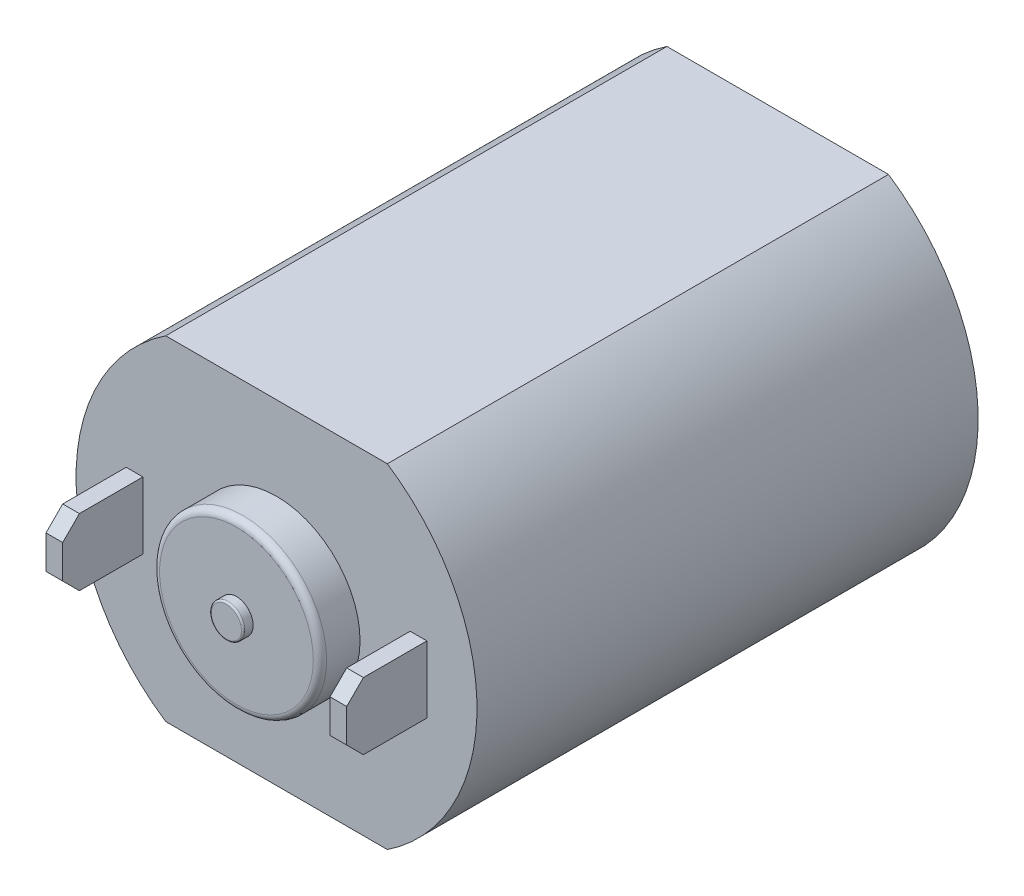
ISO-10303-21;
HEADER;
FILE_DESCRIPTION(('STEP AP214'),'2;1');
FILE_NAME('part.step','',(''),(''),'','','');
FILE_SCHEMA(('AUTOMOTIVE_DESIGN { 1 0 10303 214 1 1 1 1 }'));
ENDSEC;
DATA;
#1=APPLICATION_CONTEXT('core data for automotive mechanical design processes');
#2=APPLICATION_PROTOCOL_DEFINITION('international standard','automotive_design',2000,#1);
#3=PRODUCT_CONTEXT('',#1,'mechanical');
#4=PRODUCT('Part','Part','',(#3));
#5=PRODUCT_RELATED_PRODUCT_CATEGORY('part','',(#4));
#6=PRODUCT_DEFINITION_FORMATION('','',#4);
#7=PRODUCT_DEFINITION_CONTEXT('part definition',#1,'design');
#8=PRODUCT_DEFINITION('design','',#6,#7);
#9=PRODUCT_DEFINITION_SHAPE('','',#8);
#10=(LENGTH_UNIT() NAMED_UNIT(*) SI_UNIT(.MILLI.,.METRE.));
#11=(NAMED_UNIT(*) PLANE_ANGLE_UNIT() SI_UNIT($,.RADIAN.));
#12=(NAMED_UNIT(*) SI_UNIT($,.STERADIAN.) SOLID_ANGLE_UNIT());
#13=UNCERTAINTY_MEASURE_WITH_UNIT(LENGTH_MEASURE(1.E-05),#10,'distance_accuracy_value','');
#14=(GEOMETRIC_REPRESENTATION_CONTEXT(3) GLOBAL_UNCERTAINTY_ASSIGNED_CONTEXT((#13)) GLOBAL_UNIT_ASSIGNED_CONTEXT((#10,
#11,#12)) REPRESENTATION_CONTEXT('',''));
#15=CARTESIAN_POINT('',(0.,0.,0.));
#16=DIRECTION('',(0.,0.,1.));
#17=DIRECTION('',(1.,0.,0.));
#18=AXIS2_PLACEMENT_3D('',#15,#16,#17);
#19=CARTESIAN_POINT('',(0.,0.,15.));
#20=DIRECTION('',(0.,0.,1.));
#21=DIRECTION('',(1.,0.,0.));
#22=AXIS2_PLACEMENT_3D('',#19,#20,#21);
#23=PLANE('',#22);
#24=CARTESIAN_POINT('',(0.,0.,15.));
#25=DIRECTION('',(0.,0.,1.));
#26=DIRECTION('',(1.,0.,0.));
#27=AXIS2_PLACEMENT_3D('',#24,#25,#26);
#28=CIRCLE('',#27,2.5);
#29=CARTESIAN_POINT('',(2.5,0.,15.));
#30=VERTEX_POINT('',#29);
#31=EDGE_CURVE('E219',#30,#30,#28,.T.);
#32=ORIENTED_EDGE('',*,*,#31,.F.);
#33=EDGE_LOOP('',(#32));
#34=FACE_BOUND('',#33,.T.);
#35=DIRECTION('',(-1.,0.,0.));
#36=VECTOR('',#35,1.);
#37=CARTESIAN_POINT('',(3.3166247903554,5.,15.));
#38=LINE('',#37,#36);
#39=CARTESIAN_POINT('',(3.3166247903554,5.,15.));
#40=VERTEX_POINT('',#39);
#41=CARTESIAN_POINT('',(-3.3166247903554,5.,15.));
#42=VERTEX_POINT('',#41);
#43=EDGE_CURVE('E224',#40,#42,#38,.T.);
#44=ORIENTED_EDGE('',*,*,#43,.T.);
#45=CARTESIAN_POINT('',(0.,0.,15.));
#46=DIRECTION('',(0.,0.,1.));
#47=DIRECTION('',(1.,0.,0.));
#48=AXIS2_PLACEMENT_3D('',#45,#46,#47);
#49=CIRCLE('',#48,6.);
#50=CARTESIAN_POINT('',(-3.3166247903554,-5.,15.));
#51=VERTEX_POINT('',#50);
#52=EDGE_CURVE('E223',#42,#51,#49,.T.);
#53=ORIENTED_EDGE('',*,*,#52,.T.);
#54=DIRECTION('',(1.,0.,0.));
#55=VECTOR('',#54,1.);
#56=CARTESIAN_POINT('',(3.3166247903554,-5.,15.));
#57=LINE('',#56,#55);
#58=CARTESIAN_POINT('',(3.3166247903554,-5.,15.));
#59=VERTEX_POINT('',#58);
#60=EDGE_CURVE('E238',#51,#59,#57,.T.);
#61=ORIENTED_EDGE('',*,*,#60,.T.);
#62=EDGE_CURVE('E244',#59,#40,#49,.T.);
#63=ORIENTED_EDGE('',*,*,#62,.T.);
#64=EDGE_LOOP('',(#44,#53,#61,#63));
#65=FACE_BOUND('',#64,.T.);
#66=DIRECTION('',(0.,1.,0.));
#67=VECTOR('',#66,1.);
#68=CARTESIAN_POINT('',(4.5,1.,15.));
#69=LINE('',#68,#67);
#70=CARTESIAN_POINT('',(4.5,-1.,15.));
#71=VERTEX_POINT('',#70);
#72=CARTESIAN_POINT('',(4.5,1.,15.));
#73=VERTEX_POINT('',#72);
#74=EDGE_CURVE('E185',#71,#73,#69,.T.);
#75=ORIENTED_EDGE('',*,*,#74,.F.);
#76=DIRECTION('',(1.,0.,0.));
#77=VECTOR('',#76,1.);
#78=CARTESIAN_POINT('',(4.5,-1.,15.));
#79=LINE('',#78,#77);
#80=CARTESIAN_POINT('',(4.,-1.,15.));
#81=VERTEX_POINT('',#80);
#82=EDGE_CURVE('E182',#81,#71,#79,.T.);
#83=ORIENTED_EDGE('',*,*,#82,.F.);
#84=DIRECTION('',(0.,-1.,0.));
#85=VECTOR('',#84,1.);
#86=CARTESIAN_POINT('',(4.,0.,15.));
#87=LINE('',#86,#85);
#88=CARTESIAN_POINT('',(4.,1.,15.));
#89=VERTEX_POINT('',#88);
#90=EDGE_CURVE('E197',#89,#81,#87,.T.);
#91=ORIENTED_EDGE('',*,*,#90,.F.);
#92=DIRECTION('',(-1.,0.,0.));
#93=VECTOR('',#92,1.);
#94=CARTESIAN_POINT('',(4.,1.,15.));
#95=LINE('',#94,#93);
#96=EDGE_CURVE('E203',#73,#89,#95,.T.);
#97=ORIENTED_EDGE('',*,*,#96,.F.);
#98=EDGE_LOOP('',(#75,#83,#91,#97));
#99=FACE_BOUND('',#98,.T.);
#100=DIRECTION('',(0.,1.,0.));
#101=VECTOR('',#100,1.);
#102=CARTESIAN_POINT('',(-4.,0.,15.));
#103=LINE('',#102,#101);
#104=CARTESIAN_POINT('',(-4.,-1.,15.));
#105=VERTEX_POINT('',#104);
#106=CARTESIAN_POINT('',(-4.,1.,15.));
#107=VERTEX_POINT('',#106);
#108=EDGE_CURVE('E181',#105,#107,#103,.T.);
#109=ORIENTED_EDGE('',*,*,#108,.F.);
#110=DIRECTION('',(1.,0.,0.));
#111=VECTOR('',#110,1.);
#112=CARTESIAN_POINT('',(-4.5,-1.,15.));
#113=LINE('',#112,#111);
#114=CARTESIAN_POINT('',(-4.5,-1.,15.));
#115=VERTEX_POINT('',#114);
#116=EDGE_CURVE('E161',#115,#105,#113,.T.);
#117=ORIENTED_EDGE('',*,*,#116,.F.);
#118=DIRECTION('',(0.,-1.,0.));
#119=VECTOR('',#118,1.);
#120=CARTESIAN_POINT('',(-4.5,1.,15.));
#121=LINE('',#120,#119);
#122=CARTESIAN_POINT('',(-4.5,1.,15.));
#123=VERTEX_POINT('',#122);
#124=EDGE_CURVE('E171',#123,#115,#121,.T.);
#125=ORIENTED_EDGE('',*,*,#124,.F.);
#126=DIRECTION('',(-1.,0.,0.));
#127=VECTOR('',#126,1.);
#128=CARTESIAN_POINT('',(-4.,1.,15.));
#129=LINE('',#128,#127);
#130=EDGE_CURVE('E177',#107,#123,#129,.T.);
#131=ORIENTED_EDGE('',*,*,#130,.F.);
#132=EDGE_LOOP('',(#109,#117,#125,#131));
#133=FACE_BOUND('',#132,.T.);
#134=ADVANCED_FACE('F40',(#34,#65,#99,#133),#23,.T.);
#135=CARTESIAN_POINT('',(0.,0.,15.));
#136=DIRECTION('',(0.,0.,-1.));
#137=DIRECTION('',(-1.,0.,0.));
#138=AXIS2_PLACEMENT_3D('',#135,#136,#137);
#139=CYLINDRICAL_SURFACE('',#138,6.);
#140=ORIENTED_EDGE('',*,*,#52,.F.);
#141=DIRECTION('',(0.,0.,-1.));
#142=VECTOR('',#141,1.);
#143=CARTESIAN_POINT('',(-3.3166247903554,5.,15.));
#144=LINE('',#143,#142);
#145=CARTESIAN_POINT('',(-3.3166247903554,5.,0.));
#146=VERTEX_POINT('',#145);
#147=EDGE_CURVE('E231',#42,#146,#144,.T.);
#148=ORIENTED_EDGE('',*,*,#147,.T.);
#149=CARTESIAN_POINT('',(0.,0.,0.));
#150=DIRECTION('',(0.,0.,1.));
#151=DIRECTION('',(1.,0.,0.));
#152=AXIS2_PLACEMENT_3D('',#149,#150,#151);
#153=CIRCLE('',#152,6.);
#154=CARTESIAN_POINT('',(-3.3166247903554,-5.,0.));
#155=VERTEX_POINT('',#154);
#156=EDGE_CURVE('E247',#146,#155,#153,.T.);
#157=ORIENTED_EDGE('',*,*,#156,.T.);
#158=DIRECTION('',(0.,0.,-1.));
#159=VECTOR('',#158,1.);
#160=CARTESIAN_POINT('',(-3.3166247903554,-5.,15.));
#161=LINE('',#160,#159);
#162=EDGE_CURVE('E236',#51,#155,#161,.T.);
#163=ORIENTED_EDGE('',*,*,#162,.F.);
#164=EDGE_LOOP('',(#140,#148,#157,#163));
#165=FACE_BOUND('',#164,.T.);
#166=ADVANCED_FACE('F317',(#165),#139,.T.);
#167=CARTESIAN_POINT('',(3.3166247903554,-5.,0.));
#168=VERTEX_POINT('',#167);
#169=CARTESIAN_POINT('',(3.3166247903554,5.,0.));
#170=VERTEX_POINT('',#169);
#171=EDGE_CURVE('E234',#168,#170,#153,.T.);
#172=ORIENTED_EDGE('',*,*,#171,.T.);
#173=DIRECTION('',(0.,0.,-1.));
#174=VECTOR('',#173,1.);
#175=CARTESIAN_POINT('',(3.3166247903554,5.,15.));
#176=LINE('',#175,#174);
#177=EDGE_CURVE('E227',#40,#170,#176,.T.);
#178=ORIENTED_EDGE('',*,*,#177,.F.);
#179=ORIENTED_EDGE('',*,*,#62,.F.);
#180=DIRECTION('',(0.,0.,-1.));
#181=VECTOR('',#180,1.);
#182=CARTESIAN_POINT('',(3.3166247903554,-5.,15.));
#183=LINE('',#182,#181);
#184=EDGE_CURVE('E218',#59,#168,#183,.T.);
#185=ORIENTED_EDGE('',*,*,#184,.T.);
#186=EDGE_LOOP('',(#172,#178,#179,#185));
#187=FACE_BOUND('',#186,.T.);
#188=ADVANCED_FACE('F323',(#187),#139,.T.);
#189=CARTESIAN_POINT('',(0.,0.,0.));
#190=DIRECTION('',(0.,0.,1.));
#191=DIRECTION('',(1.,0.,0.));
#192=AXIS2_PLACEMENT_3D('',#189,#190,#191);
#193=PLANE('',#192);
#194=CARTESIAN_POINT('',(0.,0.,0.));
#195=DIRECTION('',(0.,0.,-1.));
#196=DIRECTION('',(-1.,0.,0.));
#197=AXIS2_PLACEMENT_3D('',#194,#195,#196);
#198=CIRCLE('',#197,2.);
#199=CARTESIAN_POINT('',(-2.,0.,0.));
#200=VERTEX_POINT('',#199);
#201=EDGE_CURVE('E12',#200,#200,#198,.T.);
#202=ORIENTED_EDGE('',*,*,#201,.F.);
#203=EDGE_LOOP('',(#202));
#204=FACE_BOUND('',#203,.T.);
#205=ORIENTED_EDGE('',*,*,#156,.F.);
#206=DIRECTION('',(-1.,0.,0.));
#207=VECTOR('',#206,1.);
#208=CARTESIAN_POINT('',(3.3166247903554,5.,0.));
#209=LINE('',#208,#207);
#210=EDGE_CURVE('E228',#170,#146,#209,.T.);
#211=ORIENTED_EDGE('',*,*,#210,.F.);
#212=ORIENTED_EDGE('',*,*,#171,.F.);
#213=DIRECTION('',(1.,0.,0.));
#214=VECTOR('',#213,1.);
#215=CARTESIAN_POINT('',(3.3166247903554,-5.,0.));
#216=LINE('',#215,#214);
#217=EDGE_CURVE('E230',#155,#168,#216,.T.);
#218=ORIENTED_EDGE('',*,*,#217,.F.);
#219=EDGE_LOOP('',(#205,#211,#212,#218));
#220=FACE_BOUND('',#219,.T.);
#221=ADVANCED_FACE('F332',(#204,#220),#193,.F.);
#222=CARTESIAN_POINT('',(3.3166247903554,-5.,15.));
#223=DIRECTION('',(0.,1.,0.));
#224=DIRECTION('',(0.,0.,1.));
#225=AXIS2_PLACEMENT_3D('',#222,#223,#224);
#226=PLANE('',#225);
#227=ORIENTED_EDGE('',*,*,#217,.T.);
#228=ORIENTED_EDGE('',*,*,#184,.F.);
#229=ORIENTED_EDGE('',*,*,#60,.F.);
#230=ORIENTED_EDGE('',*,*,#162,.T.);
#231=EDGE_LOOP('',(#227,#228,#229,#230));
#232=FACE_BOUND('',#231,.T.);
#233=ADVANCED_FACE('F330',(#232),#226,.F.);
#234=CARTESIAN_POINT('',(3.3166247903554,5.,15.));
#235=DIRECTION('',(0.,-1.,0.));
#236=DIRECTION('',(0.,0.,-1.));
#237=AXIS2_PLACEMENT_3D('',#234,#235,#236);
#238=PLANE('',#237);
#239=ORIENTED_EDGE('',*,*,#210,.T.);
#240=ORIENTED_EDGE('',*,*,#147,.F.);
#241=ORIENTED_EDGE('',*,*,#43,.F.);
#242=ORIENTED_EDGE('',*,*,#177,.T.);
#243=EDGE_LOOP('',(#239,#240,#241,#242));
#244=FACE_BOUND('',#243,.T.);
#245=ADVANCED_FACE('F395',(#244),#238,.F.);
#246=CARTESIAN_POINT('',(0.,0.,16.2));
#247=DIRECTION('',(0.,0.,-1.));
#248=DIRECTION('',(-1.,0.,0.));
#249=AXIS2_PLACEMENT_3D('',#246,#247,#248);
#250=CYLINDRICAL_SURFACE('',#249,2.5);
#251=CARTESIAN_POINT('',(0.,0.,16.));
#252=DIRECTION('',(0.,0.,1.));
#253=DIRECTION('',(1.,0.,0.));
#254=AXIS2_PLACEMENT_3D('',#251,#252,#253);
#255=CIRCLE('',#254,2.5);
#256=CARTESIAN_POINT('',(2.5,0.,16.));
#257=VERTEX_POINT('',#256);
#258=EDGE_CURVE('E252',#257,#257,#255,.F.);
#259=ORIENTED_EDGE('',*,*,#258,.T.);
#260=EDGE_LOOP('',(#259));
#261=FACE_BOUND('',#260,.T.);
#262=ORIENTED_EDGE('',*,*,#31,.T.);
#263=EDGE_LOOP('',(#262));
#264=FACE_BOUND('',#263,.T.);
#265=ADVANCED_FACE('F392',(#261,#264),#250,.T.);
#266=CARTESIAN_POINT('',(0.,0.,16.2));
#267=DIRECTION('',(0.,0.,1.));
#268=DIRECTION('',(1.,0.,0.));
#269=AXIS2_PLACEMENT_3D('',#266,#267,#268);
#270=PLANE('',#269);
#271=CARTESIAN_POINT('',(0.,0.,16.2));
#272=DIRECTION('',(0.,0.,1.));
#273=DIRECTION('',(1.,0.,0.));
#274=AXIS2_PLACEMENT_3D('',#271,#272,#273);
#275=CIRCLE('',#274,0.5);
#276=CARTESIAN_POINT('',(0.5,0.,16.2));
#277=VERTEX_POINT('',#276);
#278=EDGE_CURVE('E215',#277,#277,#275,.T.);
#279=ORIENTED_EDGE('',*,*,#278,.F.);
#280=EDGE_LOOP('',(#279));
#281=FACE_BOUND('',#280,.T.);
#282=CARTESIAN_POINT('',(0.,0.,16.2));
#283=DIRECTION('',(0.,0.,1.));
#284=DIRECTION('',(1.,0.,0.));
#285=AXIS2_PLACEMENT_3D('',#282,#283,#284);
#286=CIRCLE('',#285,2.3);
#287=CARTESIAN_POINT('',(2.3,0.,16.2));
#288=VERTEX_POINT('',#287);
#289=EDGE_CURVE('E222',#288,#288,#286,.T.);
#290=ORIENTED_EDGE('',*,*,#289,.T.);
#291=EDGE_LOOP('',(#290));
#292=FACE_BOUND('',#291,.T.);
#293=ADVANCED_FACE('F342',(#281,#292),#270,.T.);
#294=CARTESIAN_POINT('',(0.,0.,16.));
#295=DIRECTION('',(0.,0.,1.));
#296=DIRECTION('',(1.,0.,0.));
#297=AXIS2_PLACEMENT_3D('',#294,#295,#296);
#298=TOROIDAL_SURFACE('',#297,2.3,0.2);
#299=ORIENTED_EDGE('',*,*,#258,.F.);
#300=EDGE_LOOP('',(#299));
#301=FACE_BOUND('',#300,.T.);
#302=ORIENTED_EDGE('',*,*,#289,.F.);
#303=EDGE_LOOP('',(#302));
#304=FACE_BOUND('',#303,.T.);
#305=ADVANCED_FACE('F338',(#301,#304),#298,.T.);
#306=CARTESIAN_POINT('',(0.,0.,16.5));
#307=DIRECTION('',(0.,0.,-1.));
#308=DIRECTION('',(-1.,0.,0.));
#309=AXIS2_PLACEMENT_3D('',#306,#307,#308);
#310=CYLINDRICAL_SURFACE('',#309,0.5);
#311=CARTESIAN_POINT('',(0.,0.,16.45));
#312=DIRECTION('',(0.,0.,1.));
#313=DIRECTION('',(1.,0.,0.));
#314=AXIS2_PLACEMENT_3D('',#311,#312,#313);
#315=CIRCLE('',#314,0.5);
#316=CARTESIAN_POINT('',(0.5,0.,16.45));
#317=VERTEX_POINT('',#316);
#318=EDGE_CURVE('E258',#317,#317,#315,.F.);
#319=ORIENTED_EDGE('',*,*,#318,.T.);
#320=EDGE_LOOP('',(#319));
#321=FACE_BOUND('',#320,.T.);
#322=ORIENTED_EDGE('',*,*,#278,.T.);
#323=EDGE_LOOP('',(#322));
#324=FACE_BOUND('',#323,.T.);
#325=ADVANCED_FACE('F341',(#321,#324),#310,.T.);
#326=CARTESIAN_POINT('',(0.,0.,16.5));
#327=DIRECTION('',(0.,0.,1.));
#328=DIRECTION('',(1.,0.,0.));
#329=AXIS2_PLACEMENT_3D('',#326,#327,#328);
#330=PLANE('',#329);
#331=CARTESIAN_POINT('',(0.,0.,16.5));
#332=DIRECTION('',(0.,0.,1.));
#333=DIRECTION('',(1.,0.,0.));
#334=AXIS2_PLACEMENT_3D('',#331,#332,#333);
#335=CIRCLE('',#334,0.45);
#336=CARTESIAN_POINT('',(0.45,0.,16.5));
#337=VERTEX_POINT('',#336);
#338=EDGE_CURVE('E255',#337,#337,#335,.T.);
#339=ORIENTED_EDGE('',*,*,#338,.T.);
#340=EDGE_LOOP('',(#339));
#341=FACE_BOUND('',#340,.T.);
#342=ADVANCED_FACE('F348',(#341),#330,.T.);
#343=CARTESIAN_POINT('',(0.,0.,16.45));
#344=DIRECTION('',(0.,0.,1.));
#345=DIRECTION('',(1.,0.,0.));
#346=AXIS2_PLACEMENT_3D('',#343,#344,#345);
#347=TOROIDAL_SURFACE('',#346,0.45,0.05);
#348=ORIENTED_EDGE('',*,*,#318,.F.);
#349=EDGE_LOOP('',(#348));
#350=FACE_BOUND('',#349,.T.);
#351=ORIENTED_EDGE('',*,*,#338,.F.);
#352=EDGE_LOOP('',(#351));
#353=FACE_BOUND('',#352,.T.);
#354=ADVANCED_FACE('F344',(#350,#353),#347,.T.);
#355=CARTESIAN_POINT('',(4.5,-1.,17.4));
#356=DIRECTION('',(0.,1.,0.));
#357=DIRECTION('',(0.,0.,1.));
#358=AXIS2_PLACEMENT_3D('',#355,#356,#357);
#359=PLANE('',#358);
#360=DIRECTION('',(0.,0.,-1.));
#361=VECTOR('',#360,1.);
#362=CARTESIAN_POINT('',(4.5,-1.,17.4));
#363=LINE('',#362,#361);
#364=CARTESIAN_POINT('',(4.5,-1.,16.9));
#365=VERTEX_POINT('',#364);
#366=EDGE_CURVE('E211',#365,#71,#363,.T.);
#367=ORIENTED_EDGE('',*,*,#366,.F.);
#368=DIRECTION('',(-1.,0.,0.));
#369=VECTOR('',#368,1.);
#370=CARTESIAN_POINT('',(4.5,-1.,16.9));
#371=LINE('',#370,#369);
#372=CARTESIAN_POINT('',(4.,-1.,16.9));
#373=VERTEX_POINT('',#372);
#374=EDGE_CURVE('E65',#365,#373,#371,.T.);
#375=ORIENTED_EDGE('',*,*,#374,.T.);
#376=DIRECTION('',(0.,0.,-1.));
#377=VECTOR('',#376,1.);
#378=CARTESIAN_POINT('',(4.,-1.,17.4));
#379=LINE('',#378,#377);
#380=EDGE_CURVE('E213',#373,#81,#379,.T.);
#381=ORIENTED_EDGE('',*,*,#380,.T.);
#382=ORIENTED_EDGE('',*,*,#82,.T.);
#383=EDGE_LOOP('',(#367,#375,#381,#382));
#384=FACE_BOUND('',#383,.T.);
#385=ADVANCED_FACE('F347',(#384),#359,.F.);
#386=CARTESIAN_POINT('',(4.5,1.,17.4));
#387=DIRECTION('',(-1.,0.,0.));
#388=DIRECTION('',(0.,0.,1.));
#389=AXIS2_PLACEMENT_3D('',#386,#387,#388);
#390=PLANE('',#389);
#391=DIRECTION('',(0.,1.,0.));
#392=VECTOR('',#391,1.);
#393=CARTESIAN_POINT('',(4.5,1.,17.4));
#394=LINE('',#393,#392);
#395=CARTESIAN_POINT('',(4.5,-0.499999999999996,17.4));
#396=VERTEX_POINT('',#395);
#397=CARTESIAN_POINT('',(4.5,0.499999999999996,17.4));
#398=VERTEX_POINT('',#397);
#399=EDGE_CURVE('E196',#396,#398,#394,.T.);
#400=ORIENTED_EDGE('',*,*,#399,.F.);
#401=DIRECTION('',(0.,0.707106781186548,0.707106781186548));
#402=VECTOR('',#401,1.);
#403=CARTESIAN_POINT('',(4.5,-0.499999999999996,17.4));
#404=LINE('',#403,#402);
#405=EDGE_CURVE('E287',#396,#365,#404,.F.);
#406=ORIENTED_EDGE('',*,*,#405,.T.);
#407=ORIENTED_EDGE('',*,*,#366,.T.);
#408=ORIENTED_EDGE('',*,*,#74,.T.);
#409=DIRECTION('',(0.,0.,-1.));
#410=VECTOR('',#409,1.);
#411=CARTESIAN_POINT('',(4.5,1.,17.4));
#412=LINE('',#411,#410);
#413=CARTESIAN_POINT('',(4.5,1.,16.9));
#414=VERTEX_POINT('',#413);
#415=EDGE_CURVE('E209',#414,#73,#412,.T.);
#416=ORIENTED_EDGE('',*,*,#415,.F.);
#417=DIRECTION('',(0.,0.707106781186548,-0.707106781186548));
#418=VECTOR('',#417,1.);
#419=CARTESIAN_POINT('',(4.5,0.499999999999996,17.4));
#420=LINE('',#419,#418);
#421=EDGE_CURVE('E285',#414,#398,#420,.F.);
#422=ORIENTED_EDGE('',*,*,#421,.T.);
#423=EDGE_LOOP('',(#400,#406,#407,#408,#416,#422));
#424=FACE_BOUND('',#423,.T.);
#425=ADVANCED_FACE('F300',(#424),#390,.F.);
#426=CARTESIAN_POINT('',(4.,1.,17.4));
#427=DIRECTION('',(0.,-1.,0.));
#428=DIRECTION('',(0.,0.,-1.));
#429=AXIS2_PLACEMENT_3D('',#426,#427,#428);
#430=PLANE('',#429);
#431=DIRECTION('',(0.,0.,-1.));
#432=VECTOR('',#431,1.);
#433=CARTESIAN_POINT('',(4.,1.,17.4));
#434=LINE('',#433,#432);
#435=CARTESIAN_POINT('',(4.,1.,16.9));
#436=VERTEX_POINT('',#435);
#437=EDGE_CURVE('E199',#436,#89,#434,.T.);
#438=ORIENTED_EDGE('',*,*,#437,.F.);
#439=DIRECTION('',(1.,0.,0.));
#440=VECTOR('',#439,1.);
#441=CARTESIAN_POINT('',(4.,1.,16.9));
#442=LINE('',#441,#440);
#443=EDGE_CURVE('E45',#436,#414,#442,.T.);
#444=ORIENTED_EDGE('',*,*,#443,.T.);
#445=ORIENTED_EDGE('',*,*,#415,.T.);
#446=ORIENTED_EDGE('',*,*,#96,.T.);
#447=EDGE_LOOP('',(#438,#444,#445,#446));
#448=FACE_BOUND('',#447,.T.);
#449=ADVANCED_FACE('F295',(#448),#430,.F.);
#450=CARTESIAN_POINT('',(4.,0.,17.4));
#451=DIRECTION('',(1.,0.,0.));
#452=DIRECTION('',(0.,0.,-1.));
#453=AXIS2_PLACEMENT_3D('',#450,#451,#452);
#454=PLANE('',#453);
#455=ORIENTED_EDGE('',*,*,#380,.F.);
#456=DIRECTION('',(0.,-0.707106781186548,-0.707106781186548));
#457=VECTOR('',#456,1.);
#458=CARTESIAN_POINT('',(4.,-0.499999999999996,17.4));
#459=LINE('',#458,#457);
#460=CARTESIAN_POINT('',(4.,-0.499999999999996,17.4));
#461=VERTEX_POINT('',#460);
#462=EDGE_CURVE('E290',#373,#461,#459,.F.);
#463=ORIENTED_EDGE('',*,*,#462,.T.);
#464=DIRECTION('',(0.,-1.,0.));
#465=VECTOR('',#464,1.);
#466=CARTESIAN_POINT('',(4.,-1.,17.4));
#467=LINE('',#466,#465);
#468=CARTESIAN_POINT('',(4.,0.499999999999996,17.4));
#469=VERTEX_POINT('',#468);
#470=EDGE_CURVE('E193',#469,#461,#467,.T.);
#471=ORIENTED_EDGE('',*,*,#470,.F.);
#472=DIRECTION('',(0.,-0.707106781186548,0.707106781186548));
#473=VECTOR('',#472,1.);
#474=CARTESIAN_POINT('',(4.,0.499999999999996,17.4));
#475=LINE('',#474,#473);
#476=EDGE_CURVE('E57',#469,#436,#475,.F.);
#477=ORIENTED_EDGE('',*,*,#476,.T.);
#478=ORIENTED_EDGE('',*,*,#437,.T.);
#479=ORIENTED_EDGE('',*,*,#90,.T.);
#480=EDGE_LOOP('',(#455,#463,#471,#477,#478,#479));
#481=FACE_BOUND('',#480,.T.);
#482=ADVANCED_FACE('F307',(#481),#454,.F.);
#483=CARTESIAN_POINT('',(0.,0.,17.4));
#484=DIRECTION('',(0.,0.,-1.));
#485=DIRECTION('',(-1.,0.,0.));
#486=AXIS2_PLACEMENT_3D('',#483,#484,#485);
#487=PLANE('',#486);
#488=ORIENTED_EDGE('',*,*,#470,.T.);
#489=DIRECTION('',(1.,0.,0.));
#490=VECTOR('',#489,1.);
#491=CARTESIAN_POINT('',(0.,-0.499999999999996,17.4));
#492=LINE('',#491,#490);
#493=EDGE_CURVE('E282',#461,#396,#492,.T.);
#494=ORIENTED_EDGE('',*,*,#493,.T.);
#495=ORIENTED_EDGE('',*,*,#399,.T.);
#496=DIRECTION('',(-1.,0.,0.));
#497=VECTOR('',#496,1.);
#498=CARTESIAN_POINT('',(0.,0.499999999999996,17.4));
#499=LINE('',#498,#497);
#500=EDGE_CURVE('E279',#398,#469,#499,.T.);
#501=ORIENTED_EDGE('',*,*,#500,.T.);
#502=EDGE_LOOP('',(#488,#494,#495,#501));
#503=FACE_BOUND('',#502,.T.);
#504=ADVANCED_FACE('F305',(#503),#487,.F.);
#505=CARTESIAN_POINT('',(-4.5,-1.,17.4));
#506=DIRECTION('',(0.,1.,0.));
#507=DIRECTION('',(0.,0.,1.));
#508=AXIS2_PLACEMENT_3D('',#505,#506,#507);
#509=PLANE('',#508);
#510=DIRECTION('',(0.,0.,-1.));
#511=VECTOR('',#510,1.);
#512=CARTESIAN_POINT('',(-4.,-1.,17.4));
#513=LINE('',#512,#511);
#514=CARTESIAN_POINT('',(-4.,-1.,16.9));
#515=VERTEX_POINT('',#514);
#516=EDGE_CURVE('E656',#515,#105,#513,.T.);
#517=ORIENTED_EDGE('',*,*,#516,.F.);
#518=DIRECTION('',(-1.,0.,0.));
#519=VECTOR('',#518,1.);
#520=CARTESIAN_POINT('',(-4.5,-1.,16.9));
#521=LINE('',#520,#519);
#522=CARTESIAN_POINT('',(-4.5,-1.,16.9));
#523=VERTEX_POINT('',#522);
#524=EDGE_CURVE('E164',#515,#523,#521,.T.);
#525=ORIENTED_EDGE('',*,*,#524,.T.);
#526=DIRECTION('',(0.,0.,-1.));
#527=VECTOR('',#526,1.);
#528=CARTESIAN_POINT('',(-4.5,-1.,17.4));
#529=LINE('',#528,#527);
#530=EDGE_CURVE('E156',#523,#115,#529,.T.);
#531=ORIENTED_EDGE('',*,*,#530,.T.);
#532=ORIENTED_EDGE('',*,*,#116,.T.);
#533=EDGE_LOOP('',(#517,#525,#531,#532));
#534=FACE_BOUND('',#533,.T.);
#535=ADVANCED_FACE('F159',(#534),#509,.F.);
#536=CARTESIAN_POINT('',(-4.,0.,17.4));
#537=DIRECTION('',(-1.,0.,0.));
#538=DIRECTION('',(0.,0.,1.));
#539=AXIS2_PLACEMENT_3D('',#536,#537,#538);
#540=PLANE('',#539);
#541=DIRECTION('',(0.,1.,0.));
#542=VECTOR('',#541,1.);
#543=CARTESIAN_POINT('',(-4.,-1.,17.4));
#544=LINE('',#543,#542);
#545=CARTESIAN_POINT('',(-4.,-0.499999999999996,17.4));
#546=VERTEX_POINT('',#545);
#547=CARTESIAN_POINT('',(-4.,0.499999999999996,17.4));
#548=VERTEX_POINT('',#547);
#549=EDGE_CURVE('E178',#546,#548,#544,.T.);
#550=ORIENTED_EDGE('',*,*,#549,.F.);
#551=DIRECTION('',(0.,-0.707106781186548,-0.707106781186548));
#552=VECTOR('',#551,1.);
#553=CARTESIAN_POINT('',(-4.,-0.499999999999996,17.4));
#554=LINE('',#553,#552);
#555=EDGE_CURVE('E274',#546,#515,#554,.T.);
#556=ORIENTED_EDGE('',*,*,#555,.T.);
#557=ORIENTED_EDGE('',*,*,#516,.T.);
#558=ORIENTED_EDGE('',*,*,#108,.T.);
#559=DIRECTION('',(0.,0.,-1.));
#560=VECTOR('',#559,1.);
#561=CARTESIAN_POINT('',(-4.,1.,17.4));
#562=LINE('',#561,#560);
#563=CARTESIAN_POINT('',(-4.,1.,16.9));
#564=VERTEX_POINT('',#563);
#565=EDGE_CURVE('E658',#564,#107,#562,.T.);
#566=ORIENTED_EDGE('',*,*,#565,.F.);
#567=DIRECTION('',(0.,-0.707106781186548,0.707106781186548));
#568=VECTOR('',#567,1.);
#569=CARTESIAN_POINT('',(-4.,0.499999999999996,17.4));
#570=LINE('',#569,#568);
#571=EDGE_CURVE('E268',#564,#548,#570,.T.);
#572=ORIENTED_EDGE('',*,*,#571,.T.);
#573=EDGE_LOOP('',(#550,#556,#557,#558,#566,#572));
#574=FACE_BOUND('',#573,.T.);
#575=ADVANCED_FACE('F525',(#574),#540,.F.);
#576=CARTESIAN_POINT('',(-4.,1.,17.4));
#577=DIRECTION('',(0.,-1.,0.));
#578=DIRECTION('',(0.,0.,-1.));
#579=AXIS2_PLACEMENT_3D('',#576,#577,#578);
#580=PLANE('',#579);
#581=DIRECTION('',(0.,0.,-1.));
#582=VECTOR('',#581,1.);
#583=CARTESIAN_POINT('',(-4.5,1.,17.4));
#584=LINE('',#583,#582);
#585=CARTESIAN_POINT('',(-4.5,1.,16.9));
#586=VERTEX_POINT('',#585);
#587=EDGE_CURVE('E168',#586,#123,#584,.T.);
#588=ORIENTED_EDGE('',*,*,#587,.F.);
#589=DIRECTION('',(1.,0.,0.));
#590=VECTOR('',#589,1.);
#591=CARTESIAN_POINT('',(-4.,1.,16.9));
#592=LINE('',#591,#590);
#593=EDGE_CURVE('E266',#586,#564,#592,.T.);
#594=ORIENTED_EDGE('',*,*,#593,.T.);
#595=ORIENTED_EDGE('',*,*,#565,.T.);
#596=ORIENTED_EDGE('',*,*,#130,.T.);
#597=EDGE_LOOP('',(#588,#594,#595,#596));
#598=FACE_BOUND('',#597,.T.);
#599=ADVANCED_FACE('F534',(#598),#580,.F.);
#600=CARTESIAN_POINT('',(-4.5,1.,17.4));
#601=DIRECTION('',(1.,0.,0.));
#602=DIRECTION('',(0.,0.,-1.));
#603=AXIS2_PLACEMENT_3D('',#600,#601,#602);
#604=PLANE('',#603);
#605=ORIENTED_EDGE('',*,*,#530,.F.);
#606=DIRECTION('',(0.,0.707106781186548,0.707106781186548));
#607=VECTOR('',#606,1.);
#608=CARTESIAN_POINT('',(-4.5,-0.499999999999996,17.4));
#609=LINE('',#608,#607);
#610=CARTESIAN_POINT('',(-4.5,-0.499999999999996,17.4));
#611=VERTEX_POINT('',#610);
#612=EDGE_CURVE('E277',#523,#611,#609,.T.);
#613=ORIENTED_EDGE('',*,*,#612,.T.);
#614=DIRECTION('',(0.,-1.,0.));
#615=VECTOR('',#614,1.);
#616=CARTESIAN_POINT('',(-4.5,1.,17.4));
#617=LINE('',#616,#615);
#618=CARTESIAN_POINT('',(-4.5,0.499999999999996,17.4));
#619=VERTEX_POINT('',#618);
#620=EDGE_CURVE('E167',#619,#611,#617,.T.);
#621=ORIENTED_EDGE('',*,*,#620,.F.);
#622=DIRECTION('',(0.,0.707106781186548,-0.707106781186548));
#623=VECTOR('',#622,1.);
#624=CARTESIAN_POINT('',(-4.5,0.499999999999996,17.4));
#625=LINE('',#624,#623);
#626=EDGE_CURVE('E264',#619,#586,#625,.T.);
#627=ORIENTED_EDGE('',*,*,#626,.T.);
#628=ORIENTED_EDGE('',*,*,#587,.T.);
#629=ORIENTED_EDGE('',*,*,#124,.T.);
#630=EDGE_LOOP('',(#605,#613,#621,#627,#628,#629));
#631=FACE_BOUND('',#630,.T.);
#632=ADVANCED_FACE('F172',(#631),#604,.F.);
#633=CARTESIAN_POINT('',(0.,0.,17.4));
#634=DIRECTION('',(0.,0.,1.));
#635=DIRECTION('',(1.,0.,0.));
#636=AXIS2_PLACEMENT_3D('',#633,#634,#635);
#637=PLANE('',#636);
#638=ORIENTED_EDGE('',*,*,#620,.T.);
#639=DIRECTION('',(1.,0.,0.));
#640=VECTOR('',#639,1.);
#641=CARTESIAN_POINT('',(-4.,-0.499999999999996,17.4));
#642=LINE('',#641,#640);
#643=EDGE_CURVE('E271',#611,#546,#642,.T.);
#644=ORIENTED_EDGE('',*,*,#643,.T.);
#645=ORIENTED_EDGE('',*,*,#549,.T.);
#646=DIRECTION('',(-1.,0.,0.));
#647=VECTOR('',#646,1.);
#648=CARTESIAN_POINT('',(-4.5,0.499999999999996,17.4));
#649=LINE('',#648,#647);
#650=EDGE_CURVE('E261',#548,#619,#649,.T.);
#651=ORIENTED_EDGE('',*,*,#650,.T.);
#652=EDGE_LOOP('',(#638,#644,#645,#651));
#653=FACE_BOUND('',#652,.T.);
#654=ADVANCED_FACE('F358',(#653),#637,.T.);
#655=CARTESIAN_POINT('',(0.,0.499999999999996,17.4));
#656=DIRECTION('',(0.,0.707106781186547,0.707106781186547));
#657=DIRECTION('',(1.,0.,0.));
#658=AXIS2_PLACEMENT_3D('',#655,#656,#657);
#659=PLANE('',#658);
#660=ORIENTED_EDGE('',*,*,#571,.F.);
#661=ORIENTED_EDGE('',*,*,#593,.F.);
#662=ORIENTED_EDGE('',*,*,#626,.F.);
#663=ORIENTED_EDGE('',*,*,#650,.F.);
#664=EDGE_LOOP('',(#660,#661,#662,#663));
#665=FACE_BOUND('',#664,.T.);
#666=ADVANCED_FACE('F351',(#665),#659,.T.);
#667=CARTESIAN_POINT('',(0.,-0.499999999999996,17.4));
#668=DIRECTION('',(0.,-0.707106781186547,0.707106781186547));
#669=DIRECTION('',(-1.,0.,0.));
#670=AXIS2_PLACEMENT_3D('',#667,#668,#669);
#671=PLANE('',#670);
#672=ORIENTED_EDGE('',*,*,#612,.F.);
#673=ORIENTED_EDGE('',*,*,#524,.F.);
#674=ORIENTED_EDGE('',*,*,#555,.F.);
#675=ORIENTED_EDGE('',*,*,#643,.F.);
#676=EDGE_LOOP('',(#672,#673,#674,#675));
#677=FACE_BOUND('',#676,.T.);
#678=ADVANCED_FACE('F357',(#677),#671,.T.);
#679=CARTESIAN_POINT('',(0.,-0.499999999999996,17.4));
#680=DIRECTION('',(0.,0.707106781186547,-0.707106781186547));
#681=DIRECTION('',(1.,0.,0.));
#682=AXIS2_PLACEMENT_3D('',#679,#680,#681);
#683=PLANE('',#682);
#684=ORIENTED_EDGE('',*,*,#462,.F.);
#685=ORIENTED_EDGE('',*,*,#374,.F.);
#686=ORIENTED_EDGE('',*,*,#405,.F.);
#687=ORIENTED_EDGE('',*,*,#493,.F.);
#688=EDGE_LOOP('',(#684,#685,#686,#687));
#689=FACE_BOUND('',#688,.T.);
#690=ADVANCED_FACE('F364',(#689),#683,.F.);
#691=CARTESIAN_POINT('',(0.,0.499999999999996,17.4));
#692=DIRECTION('',(0.,-0.707106781186547,-0.707106781186547));
#693=DIRECTION('',(-1.,0.,0.));
#694=AXIS2_PLACEMENT_3D('',#691,#692,#693);
#695=PLANE('',#694);
#696=ORIENTED_EDGE('',*,*,#421,.F.);
#697=ORIENTED_EDGE('',*,*,#443,.F.);
#698=ORIENTED_EDGE('',*,*,#476,.F.);
#699=ORIENTED_EDGE('',*,*,#500,.F.);
#700=EDGE_LOOP('',(#696,#697,#698,#699));
#701=FACE_BOUND('',#700,.T.);
#702=ADVANCED_FACE('F43',(#701),#695,.F.);
#703=CARTESIAN_POINT('',(0.,0.,-0.1));
#704=DIRECTION('',(0.,0.,1.));
#705=DIRECTION('',(1.,0.,0.));
#706=AXIS2_PLACEMENT_3D('',#703,#704,#705);
#707=CYLINDRICAL_SURFACE('',#706,2.);
#708=CARTESIAN_POINT('',(0.,0.,-0.1));
#709=DIRECTION('',(0.,0.,-1.));
#710=DIRECTION('',(-1.,0.,0.));
#711=AXIS2_PLACEMENT_3D('',#708,#709,#710);
#712=CIRCLE('',#711,2.);
#713=CARTESIAN_POINT('',(-2.,0.,-0.1));
#714=VERTEX_POINT('',#713);
#715=EDGE_CURVE('E655',#714,#714,#712,.T.);
#716=ORIENTED_EDGE('',*,*,#715,.F.);
#717=EDGE_LOOP('',(#716));
#718=FACE_BOUND('',#717,.T.);
#719=ORIENTED_EDGE('',*,*,#201,.T.);
#720=EDGE_LOOP('',(#719));
#721=FACE_BOUND('',#720,.T.);
#722=ADVANCED_FACE('F373',(#718,#721),#707,.T.);
#723=CARTESIAN_POINT('',(0.,0.,-0.1));
#724=DIRECTION('',(0.,0.,-1.));
#725=DIRECTION('',(-1.,0.,0.));
#726=AXIS2_PLACEMENT_3D('',#723,#724,#725);
#727=PLANE('',#726);
#728=ORIENTED_EDGE('',*,*,#715,.T.);
#729=EDGE_LOOP('',(#728));
#730=FACE_BOUND('',#729,.T.);
#731=ADVANCED_FACE('F592',(#730),#727,.T.);
#732=CLOSED_SHELL('',(#134,#166,#188,#221,#233,#245,#265,#293,#305,#325,#342,#354,#385,#425,
#449,#482,#504,#535,#575,#599,#632,#654,#666,#678,#690,#702,#722,#731));
#733=MANIFOLD_SOLID_BREP('B2',#732);
#734=ADVANCED_BREP_SHAPE_REPRESENTATION('',(#18,#733),#14);
#735=SHAPE_DEFINITION_REPRESENTATION(#9,#734);
ENDSEC;
END-ISO-10303-21;
